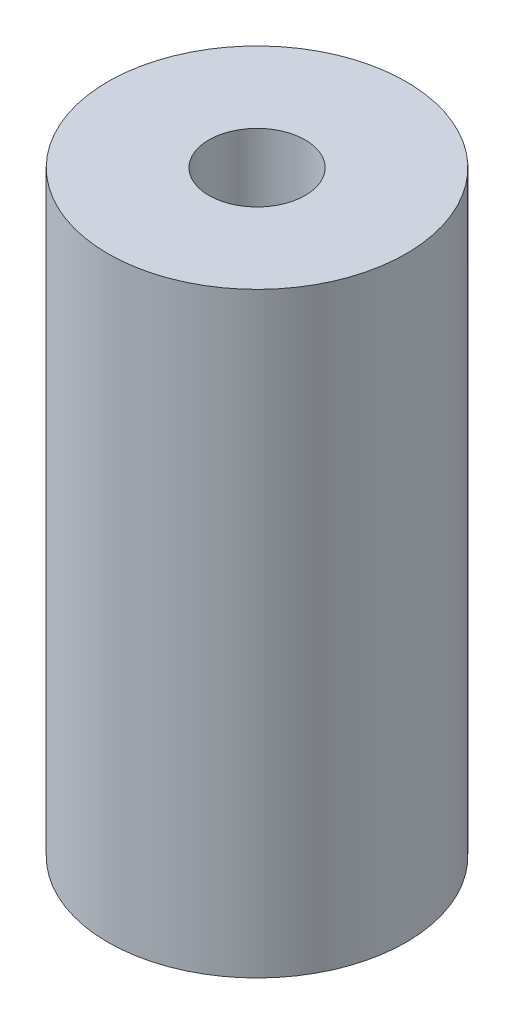
ISO-10303-21;
HEADER;
FILE_DESCRIPTION(('STEP AP214'),'2;1');
FILE_NAME('part.step','',(''),(''),'','','');
FILE_SCHEMA(('AUTOMOTIVE_DESIGN { 1 0 10303 214 1 1 1 1 }'));
ENDSEC;
DATA;
#1=APPLICATION_CONTEXT('core data for automotive mechanical design processes');
#2=APPLICATION_PROTOCOL_DEFINITION('international standard','automotive_design',2000,#1);
#3=PRODUCT_CONTEXT('',#1,'mechanical');
#4=PRODUCT('Part','Part','',(#3));
#5=PRODUCT_RELATED_PRODUCT_CATEGORY('part','',(#4));
#6=PRODUCT_DEFINITION_FORMATION('','',#4);
#7=PRODUCT_DEFINITION_CONTEXT('part definition',#1,'design');
#8=PRODUCT_DEFINITION('design','',#6,#7);
#9=PRODUCT_DEFINITION_SHAPE('','',#8);
#10=(LENGTH_UNIT() NAMED_UNIT(*) SI_UNIT(.MILLI.,.METRE.));
#11=(NAMED_UNIT(*) PLANE_ANGLE_UNIT() SI_UNIT($,.RADIAN.));
#12=(NAMED_UNIT(*) SI_UNIT($,.STERADIAN.) SOLID_ANGLE_UNIT());
#13=UNCERTAINTY_MEASURE_WITH_UNIT(LENGTH_MEASURE(1.E-05),#10,'distance_accuracy_value','');
#14=(GEOMETRIC_REPRESENTATION_CONTEXT(3) GLOBAL_UNCERTAINTY_ASSIGNED_CONTEXT((#13)) GLOBAL_UNIT_ASSIGNED_CONTEXT((#10,
#11,#12)) REPRESENTATION_CONTEXT('',''));
#15=CARTESIAN_POINT('',(0.,0.,0.));
#16=DIRECTION('',(0.,0.,1.));
#17=DIRECTION('',(1.,0.,0.));
#18=AXIS2_PLACEMENT_3D('',#15,#16,#17);
#19=CARTESIAN_POINT('',(0.,26.,0.));
#20=DIRECTION('',(0.,1.,0.));
#21=DIRECTION('',(0.,0.,1.));
#22=AXIS2_PLACEMENT_3D('',#19,#20,#21);
#23=PLANE('',#22);
#24=CARTESIAN_POINT('',(0.,26.,0.));
#25=DIRECTION('',(0.,1.,0.));
#26=DIRECTION('',(0.,0.,1.));
#27=AXIS2_PLACEMENT_3D('',#24,#25,#26);
#28=CIRCLE('',#27,6.5);
#29=CARTESIAN_POINT('',(0.,26.,6.5));
#30=VERTEX_POINT('',#29);
#31=EDGE_CURVE('E10',#30,#30,#28,.T.);
#32=ORIENTED_EDGE('',*,*,#31,.T.);
#33=EDGE_LOOP('',(#32));
#34=FACE_BOUND('',#33,.T.);
#35=CARTESIAN_POINT('',(0.,26.,0.));
#36=DIRECTION('',(0.,1.,0.));
#37=DIRECTION('',(0.,0.,1.));
#38=AXIS2_PLACEMENT_3D('',#35,#36,#37);
#39=CIRCLE('',#38,2.1);
#40=CARTESIAN_POINT('',(0.,26.,2.1));
#41=VERTEX_POINT('',#40);
#42=EDGE_CURVE('E26',#41,#41,#39,.T.);
#43=ORIENTED_EDGE('',*,*,#42,.F.);
#44=EDGE_LOOP('',(#43));
#45=FACE_BOUND('',#44,.T.);
#46=ADVANCED_FACE('F15',(#34,#45),#23,.T.);
#47=CARTESIAN_POINT('',(0.,0.,0.));
#48=DIRECTION('',(0.,1.,0.));
#49=DIRECTION('',(0.,0.,1.));
#50=AXIS2_PLACEMENT_3D('',#47,#48,#49);
#51=PLANE('',#50);
#52=CARTESIAN_POINT('',(0.,0.,0.));
#53=DIRECTION('',(0.,1.,0.));
#54=DIRECTION('',(0.,0.,1.));
#55=AXIS2_PLACEMENT_3D('',#52,#53,#54);
#56=CIRCLE('',#55,6.5);
#57=CARTESIAN_POINT('',(0.,0.,6.5));
#58=VERTEX_POINT('',#57);
#59=EDGE_CURVE('E19',#58,#58,#56,.T.);
#60=ORIENTED_EDGE('',*,*,#59,.F.);
#61=EDGE_LOOP('',(#60));
#62=FACE_BOUND('',#61,.T.);
#63=CARTESIAN_POINT('',(0.,0.,0.));
#64=DIRECTION('',(0.,1.,0.));
#65=DIRECTION('',(0.,0.,1.));
#66=AXIS2_PLACEMENT_3D('',#63,#64,#65);
#67=CIRCLE('',#66,2.1);
#68=CARTESIAN_POINT('',(0.,0.,2.1));
#69=VERTEX_POINT('',#68);
#70=EDGE_CURVE('E28',#69,#69,#67,.T.);
#71=ORIENTED_EDGE('',*,*,#70,.T.);
#72=EDGE_LOOP('',(#71));
#73=FACE_BOUND('',#72,.T.);
#74=ADVANCED_FACE('F38',(#62,#73),#51,.F.);
#75=CARTESIAN_POINT('',(0.,26.,0.));
#76=DIRECTION('',(0.,-1.,0.));
#77=DIRECTION('',(0.,0.,-1.));
#78=AXIS2_PLACEMENT_3D('',#75,#76,#77);
#79=CYLINDRICAL_SURFACE('',#78,6.5);
#80=ORIENTED_EDGE('',*,*,#31,.F.);
#81=EDGE_LOOP('',(#80));
#82=FACE_BOUND('',#81,.T.);
#83=ORIENTED_EDGE('',*,*,#59,.T.);
#84=EDGE_LOOP('',(#83));
#85=FACE_BOUND('',#84,.T.);
#86=ADVANCED_FACE('F17',(#82,#85),#79,.T.);
#87=CARTESIAN_POINT('',(0.,26.,0.));
#88=DIRECTION('',(0.,-1.,0.));
#89=DIRECTION('',(0.,0.,-1.));
#90=AXIS2_PLACEMENT_3D('',#87,#88,#89);
#91=CYLINDRICAL_SURFACE('',#90,2.1);
#92=ORIENTED_EDGE('',*,*,#42,.T.);
#93=EDGE_LOOP('',(#92));
#94=FACE_BOUND('',#93,.T.);
#95=ORIENTED_EDGE('',*,*,#70,.F.);
#96=EDGE_LOOP('',(#95));
#97=FACE_BOUND('',#96,.T.);
#98=ADVANCED_FACE('F34',(#94,#97),#91,.F.);
#99=CLOSED_SHELL('',(#46,#74,#86,#98));
#100=MANIFOLD_SOLID_BREP('B1',#99);
#101=ADVANCED_BREP_SHAPE_REPRESENTATION('',(#18,#100),#14);
#102=SHAPE_DEFINITION_REPRESENTATION(#9,#101);
ENDSEC;
END-ISO-10303-21;
